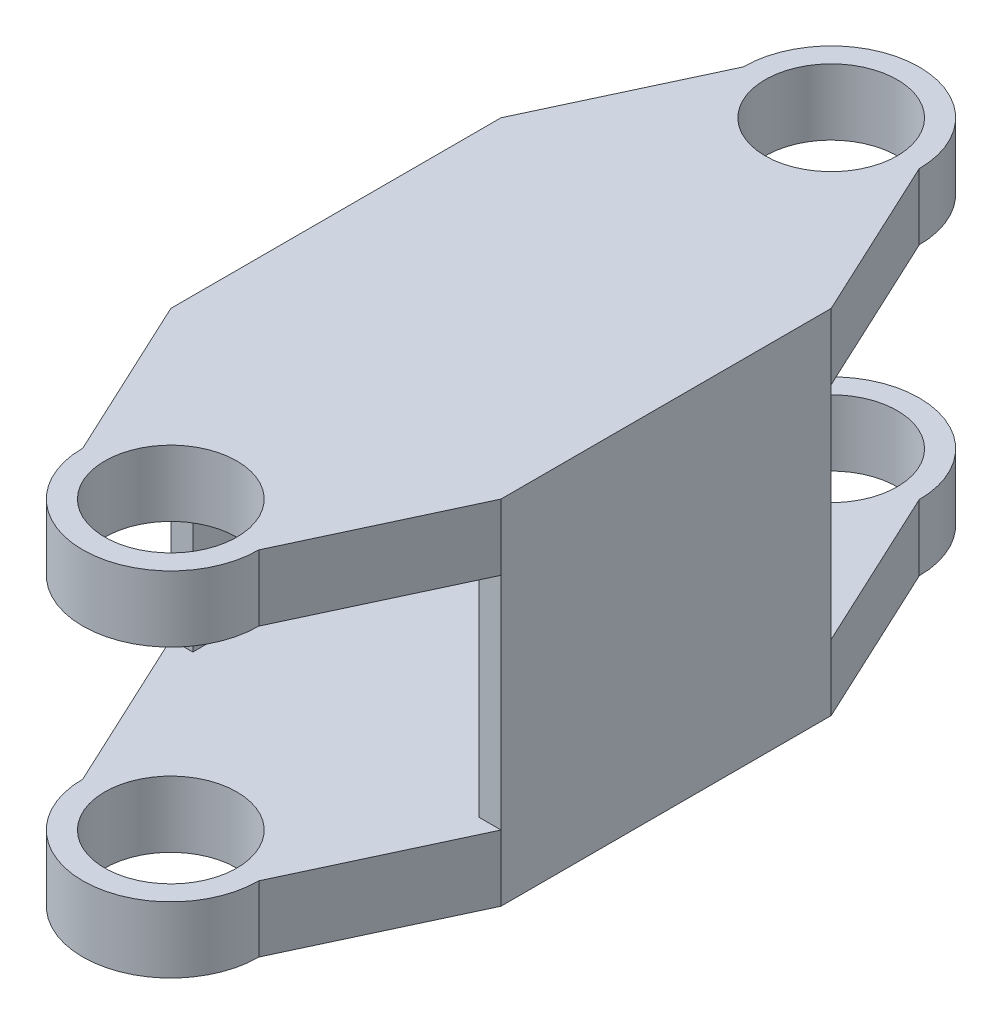
ISO-10303-21;
HEADER;
FILE_DESCRIPTION(('STEP AP214'),'2;1');
FILE_NAME('part.step','',(''),(''),'','','');
FILE_SCHEMA(('AUTOMOTIVE_DESIGN { 1 0 10303 214 1 1 1 1 }'));
ENDSEC;
DATA;
#1=APPLICATION_CONTEXT('core data for automotive mechanical design processes');
#2=APPLICATION_PROTOCOL_DEFINITION('international standard','automotive_design',2000,#1);
#3=PRODUCT_CONTEXT('',#1,'mechanical');
#4=PRODUCT('Part','Part','',(#3));
#5=PRODUCT_RELATED_PRODUCT_CATEGORY('part','',(#4));
#6=PRODUCT_DEFINITION_FORMATION('','',#4);
#7=PRODUCT_DEFINITION_CONTEXT('part definition',#1,'design');
#8=PRODUCT_DEFINITION('design','',#6,#7);
#9=PRODUCT_DEFINITION_SHAPE('','',#8);
#10=(LENGTH_UNIT() NAMED_UNIT(*) SI_UNIT(.MILLI.,.METRE.));
#11=(NAMED_UNIT(*) PLANE_ANGLE_UNIT() SI_UNIT($,.RADIAN.));
#12=(NAMED_UNIT(*) SI_UNIT($,.STERADIAN.) SOLID_ANGLE_UNIT());
#13=UNCERTAINTY_MEASURE_WITH_UNIT(LENGTH_MEASURE(1.E-05),#10,'distance_accuracy_value','');
#14=(GEOMETRIC_REPRESENTATION_CONTEXT(3) GLOBAL_UNCERTAINTY_ASSIGNED_CONTEXT((#13)) GLOBAL_UNIT_ASSIGNED_CONTEXT((#10,
#11,#12)) REPRESENTATION_CONTEXT('',''));
#15=CARTESIAN_POINT('',(0.,0.,0.));
#16=DIRECTION('',(0.,0.,1.));
#17=DIRECTION('',(1.,0.,0.));
#18=AXIS2_PLACEMENT_3D('',#15,#16,#17);
#19=CARTESIAN_POINT('',(0.,5.01,15.));
#20=DIRECTION('',(0.,1.,0.));
#21=DIRECTION('',(0.,0.,1.));
#22=AXIS2_PLACEMENT_3D('',#19,#20,#21);
#23=PLANE('',#22);
#24=CARTESIAN_POINT('',(0.,5.01,15.));
#25=DIRECTION('',(0.,1.,0.));
#26=DIRECTION('',(0.,0.,-1.));
#27=AXIS2_PLACEMENT_3D('',#24,#25,#26);
#28=CIRCLE('',#27,3.);
#29=CARTESIAN_POINT('',(0.,5.01,12.));
#30=VERTEX_POINT('',#29);
#31=EDGE_CURVE('E184',#30,#30,#28,.T.);
#32=ORIENTED_EDGE('',*,*,#31,.T.);
#33=EDGE_LOOP('',(#32));
#34=FACE_BOUND('',#33,.T.);
#35=CARTESIAN_POINT('',(0.,5.01,-15.));
#36=DIRECTION('',(0.,1.,0.));
#37=DIRECTION('',(0.,0.,1.));
#38=AXIS2_PLACEMENT_3D('',#35,#36,#37);
#39=CIRCLE('',#38,3.);
#40=CARTESIAN_POINT('',(0.,5.01,-12.));
#41=VERTEX_POINT('',#40);
#42=EDGE_CURVE('E265',#41,#41,#39,.T.);
#43=ORIENTED_EDGE('',*,*,#42,.T.);
#44=EDGE_LOOP('',(#43));
#45=FACE_BOUND('',#44,.T.);
#46=DIRECTION('',(-1.,0.,0.));
#47=VECTOR('',#46,1.);
#48=CARTESIAN_POINT('',(-7.5,5.01,-7.5));
#49=LINE('',#48,#47);
#50=CARTESIAN_POINT('',(-6.5,5.01,-7.5));
#51=VERTEX_POINT('',#50);
#52=CARTESIAN_POINT('',(-7.5,5.01,-7.5));
#53=VERTEX_POINT('',#52);
#54=EDGE_CURVE('E216',#51,#53,#49,.T.);
#55=ORIENTED_EDGE('',*,*,#54,.T.);
#56=DIRECTION('',(-0.422885465331124,0.,0.906183139995265));
#57=VECTOR('',#56,1.);
#58=CARTESIAN_POINT('',(-4.,5.01,-15.));
#59=LINE('',#58,#57);
#60=CARTESIAN_POINT('',(-4.,5.01,-15.));
#61=VERTEX_POINT('',#60);
#62=EDGE_CURVE('E156',#61,#53,#59,.T.);
#63=ORIENTED_EDGE('',*,*,#62,.F.);
#64=CARTESIAN_POINT('',(0.,5.01,-15.));
#65=DIRECTION('',(0.,1.,0.));
#66=DIRECTION('',(0.,0.,-1.));
#67=AXIS2_PLACEMENT_3D('',#64,#65,#66);
#68=CIRCLE('',#67,4.);
#69=CARTESIAN_POINT('',(4.,5.01,-15.));
#70=VERTEX_POINT('',#69);
#71=EDGE_CURVE('E154',#70,#61,#68,.T.);
#72=ORIENTED_EDGE('',*,*,#71,.F.);
#73=DIRECTION('',(-0.422885465331124,0.,-0.906183139995265));
#74=VECTOR('',#73,1.);
#75=CARTESIAN_POINT('',(4.,5.01,-15.));
#76=LINE('',#75,#74);
#77=CARTESIAN_POINT('',(7.5,5.01,-7.5));
#78=VERTEX_POINT('',#77);
#79=EDGE_CURVE('E157',#78,#70,#76,.T.);
#80=ORIENTED_EDGE('',*,*,#79,.F.);
#81=DIRECTION('',(-1.,0.,0.));
#82=VECTOR('',#81,1.);
#83=CARTESIAN_POINT('',(7.5,5.01,-7.5));
#84=LINE('',#83,#82);
#85=CARTESIAN_POINT('',(6.5,5.01,-7.5));
#86=VERTEX_POINT('',#85);
#87=EDGE_CURVE('E190',#78,#86,#84,.T.);
#88=ORIENTED_EDGE('',*,*,#87,.T.);
#89=DIRECTION('',(0.,0.,1.));
#90=VECTOR('',#89,1.);
#91=CARTESIAN_POINT('',(6.5,5.01,-7.5));
#92=LINE('',#91,#90);
#93=CARTESIAN_POINT('',(6.5,5.01,7.5));
#94=VERTEX_POINT('',#93);
#95=EDGE_CURVE('E185',#86,#94,#92,.T.);
#96=ORIENTED_EDGE('',*,*,#95,.T.);
#97=DIRECTION('',(1.,0.,0.));
#98=VECTOR('',#97,1.);
#99=CARTESIAN_POINT('',(7.5,5.01,7.5));
#100=LINE('',#99,#98);
#101=CARTESIAN_POINT('',(7.5,5.01,7.5));
#102=VERTEX_POINT('',#101);
#103=EDGE_CURVE('E182',#94,#102,#100,.T.);
#104=ORIENTED_EDGE('',*,*,#103,.T.);
#105=DIRECTION('',(0.422885465331124,0.,-0.906183139995265));
#106=VECTOR('',#105,1.);
#107=CARTESIAN_POINT('',(4.,5.01,15.));
#108=LINE('',#107,#106);
#109=CARTESIAN_POINT('',(4.,5.01,15.));
#110=VERTEX_POINT('',#109);
#111=EDGE_CURVE('E158',#110,#102,#108,.T.);
#112=ORIENTED_EDGE('',*,*,#111,.F.);
#113=CARTESIAN_POINT('',(0.,5.01,15.));
#114=DIRECTION('',(0.,1.,0.));
#115=DIRECTION('',(0.,0.,1.));
#116=AXIS2_PLACEMENT_3D('',#113,#114,#115);
#117=CIRCLE('',#116,4.);
#118=CARTESIAN_POINT('',(-4.,5.01,15.));
#119=VERTEX_POINT('',#118);
#120=EDGE_CURVE('E98',#119,#110,#117,.T.);
#121=ORIENTED_EDGE('',*,*,#120,.F.);
#122=DIRECTION('',(0.422885465331124,0.,0.906183139995265));
#123=VECTOR('',#122,1.);
#124=CARTESIAN_POINT('',(-4.,5.01,15.));
#125=LINE('',#124,#123);
#126=CARTESIAN_POINT('',(-7.5,5.01,7.5));
#127=VERTEX_POINT('',#126);
#128=EDGE_CURVE('E159',#127,#119,#125,.T.);
#129=ORIENTED_EDGE('',*,*,#128,.F.);
#130=DIRECTION('',(1.,0.,0.));
#131=VECTOR('',#130,1.);
#132=CARTESIAN_POINT('',(-7.5,5.01,7.5));
#133=LINE('',#132,#131);
#134=CARTESIAN_POINT('',(-6.5,5.01,7.5));
#135=VERTEX_POINT('',#134);
#136=EDGE_CURVE('E215',#127,#135,#133,.T.);
#137=ORIENTED_EDGE('',*,*,#136,.T.);
#138=DIRECTION('',(0.,0.,-1.));
#139=VECTOR('',#138,1.);
#140=CARTESIAN_POINT('',(-6.5,5.01,-7.5));
#141=LINE('',#140,#139);
#142=EDGE_CURVE('E212',#135,#51,#141,.T.);
#143=ORIENTED_EDGE('',*,*,#142,.T.);
#144=EDGE_LOOP('',(#55,#63,#72,#80,#88,#96,#104,#112,#121,#129,#137,#143));
#145=FACE_BOUND('',#144,.T.);
#146=ADVANCED_FACE('F55',(#34,#45,#145),#23,.F.);
#147=CARTESIAN_POINT('',(0.,8.01,15.));
#148=DIRECTION('',(0.,1.,0.));
#149=DIRECTION('',(0.,0.,1.));
#150=AXIS2_PLACEMENT_3D('',#147,#148,#149);
#151=PLANE('',#150);
#152=CARTESIAN_POINT('',(0.,8.01,-15.));
#153=DIRECTION('',(0.,1.,0.));
#154=DIRECTION('',(0.,0.,1.));
#155=AXIS2_PLACEMENT_3D('',#152,#153,#154);
#156=CIRCLE('',#155,3.);
#157=CARTESIAN_POINT('',(0.,8.01,-12.));
#158=VERTEX_POINT('',#157);
#159=EDGE_CURVE('E179',#158,#158,#156,.T.);
#160=ORIENTED_EDGE('',*,*,#159,.F.);
#161=EDGE_LOOP('',(#160));
#162=FACE_BOUND('',#161,.T.);
#163=DIRECTION('',(-0.422885465331124,0.,-0.906183139995265));
#164=VECTOR('',#163,1.);
#165=CARTESIAN_POINT('',(4.,8.01,-15.));
#166=LINE('',#165,#164);
#167=CARTESIAN_POINT('',(7.5,8.01,-7.5));
#168=VERTEX_POINT('',#167);
#169=CARTESIAN_POINT('',(4.,8.01,-15.));
#170=VERTEX_POINT('',#169);
#171=EDGE_CURVE('E167',#168,#170,#166,.T.);
#172=ORIENTED_EDGE('',*,*,#171,.T.);
#173=CARTESIAN_POINT('',(0.,8.01,-15.));
#174=DIRECTION('',(0.,1.,0.));
#175=DIRECTION('',(0.,0.,-1.));
#176=AXIS2_PLACEMENT_3D('',#173,#174,#175);
#177=CIRCLE('',#176,4.);
#178=CARTESIAN_POINT('',(-4.,8.01,-15.));
#179=VERTEX_POINT('',#178);
#180=EDGE_CURVE('E114',#170,#179,#177,.T.);
#181=ORIENTED_EDGE('',*,*,#180,.T.);
#182=DIRECTION('',(-0.422885465331124,0.,0.906183139995265));
#183=VECTOR('',#182,1.);
#184=CARTESIAN_POINT('',(-4.,8.01,-15.));
#185=LINE('',#184,#183);
#186=CARTESIAN_POINT('',(-7.5,8.01,-7.5));
#187=VERTEX_POINT('',#186);
#188=EDGE_CURVE('E274',#179,#187,#185,.T.);
#189=ORIENTED_EDGE('',*,*,#188,.T.);
#190=DIRECTION('',(0.,0.,1.));
#191=VECTOR('',#190,1.);
#192=CARTESIAN_POINT('',(-7.5,8.01,7.5));
#193=LINE('',#192,#191);
#194=CARTESIAN_POINT('',(-7.5,8.01,7.5));
#195=VERTEX_POINT('',#194);
#196=EDGE_CURVE('E276',#187,#195,#193,.T.);
#197=ORIENTED_EDGE('',*,*,#196,.T.);
#198=DIRECTION('',(0.422885465331124,0.,0.906183139995265));
#199=VECTOR('',#198,1.);
#200=CARTESIAN_POINT('',(-4.,8.01,15.));
#201=LINE('',#200,#199);
#202=CARTESIAN_POINT('',(-4.,8.01,15.));
#203=VERTEX_POINT('',#202);
#204=EDGE_CURVE('E136',#195,#203,#201,.T.);
#205=ORIENTED_EDGE('',*,*,#204,.T.);
#206=CARTESIAN_POINT('',(0.,8.01,15.));
#207=DIRECTION('',(0.,1.,0.));
#208=DIRECTION('',(0.,0.,1.));
#209=AXIS2_PLACEMENT_3D('',#206,#207,#208);
#210=CIRCLE('',#209,4.);
#211=CARTESIAN_POINT('',(4.,8.01,15.));
#212=VERTEX_POINT('',#211);
#213=EDGE_CURVE('E129',#203,#212,#210,.T.);
#214=ORIENTED_EDGE('',*,*,#213,.T.);
#215=DIRECTION('',(0.422885465331124,0.,-0.906183139995265));
#216=VECTOR('',#215,1.);
#217=CARTESIAN_POINT('',(4.,8.01,15.));
#218=LINE('',#217,#216);
#219=CARTESIAN_POINT('',(7.5,8.01,7.5));
#220=VERTEX_POINT('',#219);
#221=EDGE_CURVE('E133',#212,#220,#218,.T.);
#222=ORIENTED_EDGE('',*,*,#221,.T.);
#223=DIRECTION('',(0.,0.,-1.));
#224=VECTOR('',#223,1.);
#225=CARTESIAN_POINT('',(7.5,8.01,7.5));
#226=LINE('',#225,#224);
#227=EDGE_CURVE('E74',#220,#168,#226,.T.);
#228=ORIENTED_EDGE('',*,*,#227,.T.);
#229=EDGE_LOOP('',(#172,#181,#189,#197,#205,#214,#222,#228));
#230=FACE_BOUND('',#229,.T.);
#231=CARTESIAN_POINT('',(0.,8.01,15.));
#232=DIRECTION('',(0.,1.,0.));
#233=DIRECTION('',(0.,0.,-1.));
#234=AXIS2_PLACEMENT_3D('',#231,#232,#233);
#235=CIRCLE('',#234,3.);
#236=CARTESIAN_POINT('',(0.,8.01,12.));
#237=VERTEX_POINT('',#236);
#238=EDGE_CURVE('E262',#237,#237,#235,.T.);
#239=ORIENTED_EDGE('',*,*,#238,.F.);
#240=EDGE_LOOP('',(#239));
#241=FACE_BOUND('',#240,.T.);
#242=ADVANCED_FACE('F130',(#162,#230,#241),#151,.T.);
#243=CARTESIAN_POINT('',(4.,8.01,-15.));
#244=DIRECTION('',(-0.906183139995266,0.,0.422885465331124));
#245=DIRECTION('',(0.422885465331124,0.,0.906183139995266));
#246=AXIS2_PLACEMENT_3D('',#243,#244,#245);
#247=PLANE('',#246);
#248=ORIENTED_EDGE('',*,*,#79,.T.);
#249=DIRECTION('',(0.,-1.,0.));
#250=VECTOR('',#249,1.);
#251=CARTESIAN_POINT('',(4.,8.01,-15.));
#252=LINE('',#251,#250);
#253=EDGE_CURVE('E12',#170,#70,#252,.T.);
#254=ORIENTED_EDGE('',*,*,#253,.F.);
#255=ORIENTED_EDGE('',*,*,#171,.F.);
#256=DIRECTION('',(0.,-1.,0.));
#257=VECTOR('',#256,1.);
#258=CARTESIAN_POINT('',(7.5,8.01,-7.5));
#259=LINE('',#258,#257);
#260=EDGE_CURVE('E150',#168,#78,#259,.T.);
#261=ORIENTED_EDGE('',*,*,#260,.T.);
#262=EDGE_LOOP('',(#248,#254,#255,#261));
#263=FACE_BOUND('',#262,.T.);
#264=ADVANCED_FACE('F57',(#263),#247,.F.);
#265=CARTESIAN_POINT('',(0.,8.01,-15.));
#266=DIRECTION('',(0.,-1.,0.));
#267=DIRECTION('',(0.,0.,-1.));
#268=AXIS2_PLACEMENT_3D('',#265,#266,#267);
#269=CYLINDRICAL_SURFACE('',#268,4.);
#270=ORIENTED_EDGE('',*,*,#71,.T.);
#271=DIRECTION('',(0.,-1.,0.));
#272=VECTOR('',#271,1.);
#273=CARTESIAN_POINT('',(-4.,8.01,-15.));
#274=LINE('',#273,#272);
#275=EDGE_CURVE('E65',#179,#61,#274,.T.);
#276=ORIENTED_EDGE('',*,*,#275,.F.);
#277=ORIENTED_EDGE('',*,*,#180,.F.);
#278=ORIENTED_EDGE('',*,*,#253,.T.);
#279=EDGE_LOOP('',(#270,#276,#277,#278));
#280=FACE_BOUND('',#279,.T.);
#281=ADVANCED_FACE('F301',(#280),#269,.T.);
#282=CARTESIAN_POINT('',(-4.,8.01,-15.));
#283=DIRECTION('',(0.906183139995265,0.,0.422885465331124));
#284=DIRECTION('',(0.422885465331124,0.,-0.906183139995265));
#285=AXIS2_PLACEMENT_3D('',#282,#283,#284);
#286=PLANE('',#285);
#287=ORIENTED_EDGE('',*,*,#62,.T.);
#288=DIRECTION('',(0.,-1.,0.));
#289=VECTOR('',#288,1.);
#290=CARTESIAN_POINT('',(-7.5,8.01,-7.5));
#291=LINE('',#290,#289);
#292=EDGE_CURVE('E164',#187,#53,#291,.T.);
#293=ORIENTED_EDGE('',*,*,#292,.F.);
#294=ORIENTED_EDGE('',*,*,#188,.F.);
#295=ORIENTED_EDGE('',*,*,#275,.T.);
#296=EDGE_LOOP('',(#287,#293,#294,#295));
#297=FACE_BOUND('',#296,.T.);
#298=ADVANCED_FACE('F303',(#297),#286,.F.);
#299=CARTESIAN_POINT('',(-7.5,8.01,7.5));
#300=DIRECTION('',(1.,0.,0.));
#301=DIRECTION('',(0.,0.,-1.));
#302=AXIS2_PLACEMENT_3D('',#299,#300,#301);
#303=PLANE('',#302);
#304=ORIENTED_EDGE('',*,*,#292,.T.);
#305=DIRECTION('',(0.,1.,0.));
#306=VECTOR('',#305,1.);
#307=CARTESIAN_POINT('',(-7.5,0.,-7.5));
#308=LINE('',#307,#306);
#309=CARTESIAN_POINT('',(-7.5,-5.01,-7.5));
#310=VERTEX_POINT('',#309);
#311=EDGE_CURVE('E238',#310,#53,#308,.T.);
#312=ORIENTED_EDGE('',*,*,#311,.F.);
#313=DIRECTION('',(0.,1.,0.));
#314=VECTOR('',#313,1.);
#315=CARTESIAN_POINT('',(-7.5,-8.01,-7.5));
#316=LINE('',#315,#314);
#317=CARTESIAN_POINT('',(-7.5,-8.01,-7.5));
#318=VERTEX_POINT('',#317);
#319=EDGE_CURVE('E418',#318,#310,#316,.T.);
#320=ORIENTED_EDGE('',*,*,#319,.F.);
#321=DIRECTION('',(0.,0.,1.));
#322=VECTOR('',#321,1.);
#323=CARTESIAN_POINT('',(-7.5,-8.01,7.5));
#324=LINE('',#323,#322);
#325=CARTESIAN_POINT('',(-7.5,-8.01,7.5));
#326=VERTEX_POINT('',#325);
#327=EDGE_CURVE('E490',#318,#326,#324,.T.);
#328=ORIENTED_EDGE('',*,*,#327,.T.);
#329=DIRECTION('',(0.,1.,0.));
#330=VECTOR('',#329,1.);
#331=CARTESIAN_POINT('',(-7.5,-8.01,7.5));
#332=LINE('',#331,#330);
#333=CARTESIAN_POINT('',(-7.5,-5.01,7.5));
#334=VERTEX_POINT('',#333);
#335=EDGE_CURVE('E414',#326,#334,#332,.T.);
#336=ORIENTED_EDGE('',*,*,#335,.T.);
#337=DIRECTION('',(0.,1.,0.));
#338=VECTOR('',#337,1.);
#339=CARTESIAN_POINT('',(-7.5,0.,7.5));
#340=LINE('',#339,#338);
#341=EDGE_CURVE('E285',#334,#127,#340,.T.);
#342=ORIENTED_EDGE('',*,*,#341,.T.);
#343=DIRECTION('',(0.,-1.,0.));
#344=VECTOR('',#343,1.);
#345=CARTESIAN_POINT('',(-7.5,8.01,7.5));
#346=LINE('',#345,#344);
#347=EDGE_CURVE('E162',#195,#127,#346,.T.);
#348=ORIENTED_EDGE('',*,*,#347,.F.);
#349=ORIENTED_EDGE('',*,*,#196,.F.);
#350=EDGE_LOOP('',(#304,#312,#320,#328,#336,#342,#348,#349));
#351=FACE_BOUND('',#350,.T.);
#352=ADVANCED_FACE('F282',(#351),#303,.F.);
#353=CARTESIAN_POINT('',(-4.,8.01,15.));
#354=DIRECTION('',(0.906183139995265,0.,-0.422885465331124));
#355=DIRECTION('',(-0.422885465331124,0.,-0.906183139995265));
#356=AXIS2_PLACEMENT_3D('',#353,#354,#355);
#357=PLANE('',#356);
#358=ORIENTED_EDGE('',*,*,#128,.T.);
#359=DIRECTION('',(0.,-1.,0.));
#360=VECTOR('',#359,1.);
#361=CARTESIAN_POINT('',(-4.,8.01,15.));
#362=LINE('',#361,#360);
#363=EDGE_CURVE('E144',#203,#119,#362,.T.);
#364=ORIENTED_EDGE('',*,*,#363,.F.);
#365=ORIENTED_EDGE('',*,*,#204,.F.);
#366=ORIENTED_EDGE('',*,*,#347,.T.);
#367=EDGE_LOOP('',(#358,#364,#365,#366));
#368=FACE_BOUND('',#367,.T.);
#369=ADVANCED_FACE('F289',(#368),#357,.F.);
#370=CARTESIAN_POINT('',(0.,8.01,15.));
#371=DIRECTION('',(0.,-1.,0.));
#372=DIRECTION('',(0.,0.,-1.));
#373=AXIS2_PLACEMENT_3D('',#370,#371,#372);
#374=CYLINDRICAL_SURFACE('',#373,4.);
#375=ORIENTED_EDGE('',*,*,#120,.T.);
#376=DIRECTION('',(0.,-1.,0.));
#377=VECTOR('',#376,1.);
#378=CARTESIAN_POINT('',(4.,8.01,15.));
#379=LINE('',#378,#377);
#380=EDGE_CURVE('E139',#212,#110,#379,.T.);
#381=ORIENTED_EDGE('',*,*,#380,.F.);
#382=ORIENTED_EDGE('',*,*,#213,.F.);
#383=ORIENTED_EDGE('',*,*,#363,.T.);
#384=EDGE_LOOP('',(#375,#381,#382,#383));
#385=FACE_BOUND('',#384,.T.);
#386=ADVANCED_FACE('F140',(#385),#374,.T.);
#387=CARTESIAN_POINT('',(4.,8.01,15.));
#388=DIRECTION('',(-0.906183139995265,0.,-0.422885465331124));
#389=DIRECTION('',(-0.422885465331124,0.,0.906183139995265));
#390=AXIS2_PLACEMENT_3D('',#387,#388,#389);
#391=PLANE('',#390);
#392=ORIENTED_EDGE('',*,*,#111,.T.);
#393=DIRECTION('',(0.,-1.,0.));
#394=VECTOR('',#393,1.);
#395=CARTESIAN_POINT('',(7.5,8.01,7.5));
#396=LINE('',#395,#394);
#397=EDGE_CURVE('E145',#220,#102,#396,.T.);
#398=ORIENTED_EDGE('',*,*,#397,.F.);
#399=ORIENTED_EDGE('',*,*,#221,.F.);
#400=ORIENTED_EDGE('',*,*,#380,.T.);
#401=EDGE_LOOP('',(#392,#398,#399,#400));
#402=FACE_BOUND('',#401,.T.);
#403=ADVANCED_FACE('F147',(#402),#391,.F.);
#404=CARTESIAN_POINT('',(7.5,8.01,7.5));
#405=DIRECTION('',(-1.,0.,0.));
#406=DIRECTION('',(0.,0.,1.));
#407=AXIS2_PLACEMENT_3D('',#404,#405,#406);
#408=PLANE('',#407);
#409=ORIENTED_EDGE('',*,*,#397,.T.);
#410=DIRECTION('',(0.,1.,0.));
#411=VECTOR('',#410,1.);
#412=CARTESIAN_POINT('',(7.5,0.,7.5));
#413=LINE('',#412,#411);
#414=CARTESIAN_POINT('',(7.5,-5.01,7.5));
#415=VERTEX_POINT('',#414);
#416=EDGE_CURVE('E106',#415,#102,#413,.T.);
#417=ORIENTED_EDGE('',*,*,#416,.F.);
#418=DIRECTION('',(0.,1.,0.));
#419=VECTOR('',#418,1.);
#420=CARTESIAN_POINT('',(7.5,-8.01,7.5));
#421=LINE('',#420,#419);
#422=CARTESIAN_POINT('',(7.5,-8.01,7.5));
#423=VERTEX_POINT('',#422);
#424=EDGE_CURVE('E394',#423,#415,#421,.T.);
#425=ORIENTED_EDGE('',*,*,#424,.F.);
#426=DIRECTION('',(0.,0.,-1.));
#427=VECTOR('',#426,1.);
#428=CARTESIAN_POINT('',(7.5,-8.01,7.5));
#429=LINE('',#428,#427);
#430=CARTESIAN_POINT('',(7.5,-8.01,-7.5));
#431=VERTEX_POINT('',#430);
#432=EDGE_CURVE('E427',#423,#431,#429,.T.);
#433=ORIENTED_EDGE('',*,*,#432,.T.);
#434=DIRECTION('',(0.,1.,0.));
#435=VECTOR('',#434,1.);
#436=CARTESIAN_POINT('',(7.5,-8.01,-7.5));
#437=LINE('',#436,#435);
#438=CARTESIAN_POINT('',(7.5,-5.01,-7.5));
#439=VERTEX_POINT('',#438);
#440=EDGE_CURVE('E423',#431,#439,#437,.T.);
#441=ORIENTED_EDGE('',*,*,#440,.T.);
#442=DIRECTION('',(0.,1.,0.));
#443=VECTOR('',#442,1.);
#444=CARTESIAN_POINT('',(7.5,0.,-7.5));
#445=LINE('',#444,#443);
#446=EDGE_CURVE('E249',#439,#78,#445,.T.);
#447=ORIENTED_EDGE('',*,*,#446,.T.);
#448=ORIENTED_EDGE('',*,*,#260,.F.);
#449=ORIENTED_EDGE('',*,*,#227,.F.);
#450=EDGE_LOOP('',(#409,#417,#425,#433,#441,#447,#448,#449));
#451=FACE_BOUND('',#450,.T.);
#452=ADVANCED_FACE('F291',(#451),#408,.F.);
#453=CARTESIAN_POINT('',(0.,8.01,-15.));
#454=DIRECTION('',(0.,-1.,0.));
#455=DIRECTION('',(0.,0.,-1.));
#456=AXIS2_PLACEMENT_3D('',#453,#454,#455);
#457=CYLINDRICAL_SURFACE('',#456,3.);
#458=ORIENTED_EDGE('',*,*,#159,.T.);
#459=EDGE_LOOP('',(#458));
#460=FACE_BOUND('',#459,.T.);
#461=ORIENTED_EDGE('',*,*,#42,.F.);
#462=EDGE_LOOP('',(#461));
#463=FACE_BOUND('',#462,.T.);
#464=ADVANCED_FACE('F552',(#460,#463),#457,.F.);
#465=CARTESIAN_POINT('',(0.,8.01,15.));
#466=DIRECTION('',(0.,-1.,0.));
#467=DIRECTION('',(0.,0.,-1.));
#468=AXIS2_PLACEMENT_3D('',#465,#466,#467);
#469=CYLINDRICAL_SURFACE('',#468,3.);
#470=ORIENTED_EDGE('',*,*,#238,.T.);
#471=EDGE_LOOP('',(#470));
#472=FACE_BOUND('',#471,.T.);
#473=ORIENTED_EDGE('',*,*,#31,.F.);
#474=EDGE_LOOP('',(#473));
#475=FACE_BOUND('',#474,.T.);
#476=ADVANCED_FACE('F595',(#472,#475),#469,.F.);
#477=CARTESIAN_POINT('',(0.,0.,-7.5));
#478=DIRECTION('',(0.,0.,1.));
#479=DIRECTION('',(1.,0.,0.));
#480=AXIS2_PLACEMENT_3D('',#477,#478,#479);
#481=PLANE('',#480);
#482=DIRECTION('',(0.,1.,0.));
#483=VECTOR('',#482,1.);
#484=CARTESIAN_POINT('',(6.5,0.,-7.5));
#485=LINE('',#484,#483);
#486=CARTESIAN_POINT('',(6.5,-5.01,-7.5));
#487=VERTEX_POINT('',#486);
#488=EDGE_CURVE('E221',#487,#86,#485,.T.);
#489=ORIENTED_EDGE('',*,*,#488,.T.);
#490=ORIENTED_EDGE('',*,*,#87,.F.);
#491=ORIENTED_EDGE('',*,*,#446,.F.);
#492=DIRECTION('',(-1.,0.,0.));
#493=VECTOR('',#492,1.);
#494=CARTESIAN_POINT('',(7.5,-5.01,-7.5));
#495=LINE('',#494,#493);
#496=EDGE_CURVE('E441',#439,#487,#495,.T.);
#497=ORIENTED_EDGE('',*,*,#496,.T.);
#498=EDGE_LOOP('',(#489,#490,#491,#497));
#499=FACE_BOUND('',#498,.T.);
#500=ADVANCED_FACE('F328',(#499),#481,.F.);
#501=CARTESIAN_POINT('',(6.5,0.,0.));
#502=DIRECTION('',(1.,0.,0.));
#503=DIRECTION('',(0.,1.,0.));
#504=AXIS2_PLACEMENT_3D('',#501,#502,#503);
#505=PLANE('',#504);
#506=DIRECTION('',(0.,1.,0.));
#507=VECTOR('',#506,1.);
#508=CARTESIAN_POINT('',(6.5,0.,7.5));
#509=LINE('',#508,#507);
#510=CARTESIAN_POINT('',(6.5,-5.01,7.5));
#511=VERTEX_POINT('',#510);
#512=EDGE_CURVE('E246',#511,#94,#509,.T.);
#513=ORIENTED_EDGE('',*,*,#512,.T.);
#514=ORIENTED_EDGE('',*,*,#95,.F.);
#515=ORIENTED_EDGE('',*,*,#488,.F.);
#516=DIRECTION('',(0.,0.,1.));
#517=VECTOR('',#516,1.);
#518=CARTESIAN_POINT('',(6.5,-5.01,-7.5));
#519=LINE('',#518,#517);
#520=EDGE_CURVE('E338',#487,#511,#519,.T.);
#521=ORIENTED_EDGE('',*,*,#520,.T.);
#522=EDGE_LOOP('',(#513,#514,#515,#521));
#523=FACE_BOUND('',#522,.T.);
#524=ADVANCED_FACE('F333',(#523),#505,.F.);
#525=CARTESIAN_POINT('',(0.,0.,7.5));
#526=DIRECTION('',(0.,0.,-1.));
#527=DIRECTION('',(-1.,0.,0.));
#528=AXIS2_PLACEMENT_3D('',#525,#526,#527);
#529=PLANE('',#528);
#530=ORIENTED_EDGE('',*,*,#416,.T.);
#531=ORIENTED_EDGE('',*,*,#103,.F.);
#532=ORIENTED_EDGE('',*,*,#512,.F.);
#533=DIRECTION('',(1.,0.,0.));
#534=VECTOR('',#533,1.);
#535=CARTESIAN_POINT('',(7.5,-5.01,7.5));
#536=LINE('',#535,#534);
#537=EDGE_CURVE('E341',#511,#415,#536,.T.);
#538=ORIENTED_EDGE('',*,*,#537,.T.);
#539=EDGE_LOOP('',(#530,#531,#532,#538));
#540=FACE_BOUND('',#539,.T.);
#541=ADVANCED_FACE('F340',(#540),#529,.F.);
#542=CARTESIAN_POINT('',(0.,0.,-7.49999999999999));
#543=DIRECTION('',(0.,0.,1.));
#544=DIRECTION('',(1.,0.,0.));
#545=AXIS2_PLACEMENT_3D('',#542,#543,#544);
#546=PLANE('',#545);
#547=ORIENTED_EDGE('',*,*,#311,.T.);
#548=ORIENTED_EDGE('',*,*,#54,.F.);
#549=DIRECTION('',(0.,1.,0.));
#550=VECTOR('',#549,1.);
#551=CARTESIAN_POINT('',(-6.5,0.,-7.5));
#552=LINE('',#551,#550);
#553=CARTESIAN_POINT('',(-6.5,-5.01,-7.5));
#554=VERTEX_POINT('',#553);
#555=EDGE_CURVE('E224',#554,#51,#552,.T.);
#556=ORIENTED_EDGE('',*,*,#555,.F.);
#557=DIRECTION('',(-1.,0.,0.));
#558=VECTOR('',#557,1.);
#559=CARTESIAN_POINT('',(-7.5,-5.01,-7.5));
#560=LINE('',#559,#558);
#561=EDGE_CURVE('E462',#554,#310,#560,.T.);
#562=ORIENTED_EDGE('',*,*,#561,.T.);
#563=EDGE_LOOP('',(#547,#548,#556,#562));
#564=FACE_BOUND('',#563,.T.);
#565=ADVANCED_FACE('F477',(#564),#546,.F.);
#566=CARTESIAN_POINT('',(0.,0.,7.5));
#567=DIRECTION('',(0.,0.,-1.));
#568=DIRECTION('',(-1.,0.,0.));
#569=AXIS2_PLACEMENT_3D('',#566,#567,#568);
#570=PLANE('',#569);
#571=DIRECTION('',(0.,1.,0.));
#572=VECTOR('',#571,1.);
#573=CARTESIAN_POINT('',(-6.5,0.,7.5));
#574=LINE('',#573,#572);
#575=CARTESIAN_POINT('',(-6.5,-5.01,7.5));
#576=VERTEX_POINT('',#575);
#577=EDGE_CURVE('E230',#576,#135,#574,.T.);
#578=ORIENTED_EDGE('',*,*,#577,.T.);
#579=ORIENTED_EDGE('',*,*,#136,.F.);
#580=ORIENTED_EDGE('',*,*,#341,.F.);
#581=DIRECTION('',(1.,0.,0.));
#582=VECTOR('',#581,1.);
#583=CARTESIAN_POINT('',(-7.5,-5.01,7.5));
#584=LINE('',#583,#582);
#585=EDGE_CURVE('E445',#334,#576,#584,.T.);
#586=ORIENTED_EDGE('',*,*,#585,.T.);
#587=EDGE_LOOP('',(#578,#579,#580,#586));
#588=FACE_BOUND('',#587,.T.);
#589=ADVANCED_FACE('F487',(#588),#570,.F.);
#590=CARTESIAN_POINT('',(-6.5,0.,0.));
#591=DIRECTION('',(-1.,0.,0.));
#592=DIRECTION('',(0.,0.,1.));
#593=AXIS2_PLACEMENT_3D('',#590,#591,#592);
#594=PLANE('',#593);
#595=ORIENTED_EDGE('',*,*,#555,.T.);
#596=ORIENTED_EDGE('',*,*,#142,.F.);
#597=ORIENTED_EDGE('',*,*,#577,.F.);
#598=DIRECTION('',(0.,0.,-1.));
#599=VECTOR('',#598,1.);
#600=CARTESIAN_POINT('',(-6.5,-5.01,-7.5));
#601=LINE('',#600,#599);
#602=EDGE_CURVE('E460',#576,#554,#601,.T.);
#603=ORIENTED_EDGE('',*,*,#602,.T.);
#604=EDGE_LOOP('',(#595,#596,#597,#603));
#605=FACE_BOUND('',#604,.T.);
#606=ADVANCED_FACE('F485',(#605),#594,.F.);
#607=CARTESIAN_POINT('',(0.,-5.01,15.));
#608=DIRECTION('',(0.,-1.,0.));
#609=DIRECTION('',(0.,0.,1.));
#610=AXIS2_PLACEMENT_3D('',#607,#608,#609);
#611=PLANE('',#610);
#612=CARTESIAN_POINT('',(0.,-5.01,15.));
#613=DIRECTION('',(0.,1.,0.));
#614=DIRECTION('',(0.,0.,-1.));
#615=AXIS2_PLACEMENT_3D('',#612,#613,#614);
#616=CIRCLE('',#615,3.);
#617=CARTESIAN_POINT('',(0.,-5.01,12.));
#618=VERTEX_POINT('',#617);
#619=EDGE_CURVE('E437',#618,#618,#616,.T.);
#620=ORIENTED_EDGE('',*,*,#619,.F.);
#621=EDGE_LOOP('',(#620));
#622=FACE_BOUND('',#621,.T.);
#623=CARTESIAN_POINT('',(0.,-5.01,-15.));
#624=DIRECTION('',(0.,1.,0.));
#625=DIRECTION('',(0.,0.,1.));
#626=AXIS2_PLACEMENT_3D('',#623,#624,#625);
#627=CIRCLE('',#626,3.);
#628=CARTESIAN_POINT('',(0.,-5.01,-12.));
#629=VERTEX_POINT('',#628);
#630=EDGE_CURVE('E518',#629,#629,#627,.T.);
#631=ORIENTED_EDGE('',*,*,#630,.F.);
#632=EDGE_LOOP('',(#631));
#633=FACE_BOUND('',#632,.T.);
#634=ORIENTED_EDGE('',*,*,#561,.F.);
#635=ORIENTED_EDGE('',*,*,#602,.F.);
#636=ORIENTED_EDGE('',*,*,#585,.F.);
#637=DIRECTION('',(0.422885465331124,0.,0.906183139995265));
#638=VECTOR('',#637,1.);
#639=CARTESIAN_POINT('',(-4.,-5.01,15.));
#640=LINE('',#639,#638);
#641=CARTESIAN_POINT('',(-4.,-5.01,15.));
#642=VERTEX_POINT('',#641);
#643=EDGE_CURVE('E405',#334,#642,#640,.T.);
#644=ORIENTED_EDGE('',*,*,#643,.T.);
#645=CARTESIAN_POINT('',(0.,-5.01,15.));
#646=DIRECTION('',(0.,1.,0.));
#647=DIRECTION('',(0.,0.,1.));
#648=AXIS2_PLACEMENT_3D('',#645,#646,#647);
#649=CIRCLE('',#648,4.);
#650=CARTESIAN_POINT('',(4.,-5.01,15.));
#651=VERTEX_POINT('',#650);
#652=EDGE_CURVE('E386',#642,#651,#649,.T.);
#653=ORIENTED_EDGE('',*,*,#652,.T.);
#654=DIRECTION('',(0.422885465331124,0.,-0.906183139995265));
#655=VECTOR('',#654,1.);
#656=CARTESIAN_POINT('',(4.,-5.01,15.));
#657=LINE('',#656,#655);
#658=EDGE_CURVE('E396',#651,#415,#657,.T.);
#659=ORIENTED_EDGE('',*,*,#658,.T.);
#660=ORIENTED_EDGE('',*,*,#537,.F.);
#661=ORIENTED_EDGE('',*,*,#520,.F.);
#662=ORIENTED_EDGE('',*,*,#496,.F.);
#663=DIRECTION('',(-0.422885465331124,0.,-0.906183139995265));
#664=VECTOR('',#663,1.);
#665=CARTESIAN_POINT('',(4.,-5.01,-15.));
#666=LINE('',#665,#664);
#667=CARTESIAN_POINT('',(4.,-5.01,-15.));
#668=VERTEX_POINT('',#667);
#669=EDGE_CURVE('E430',#439,#668,#666,.T.);
#670=ORIENTED_EDGE('',*,*,#669,.T.);
#671=CARTESIAN_POINT('',(0.,-5.01,-15.));
#672=DIRECTION('',(0.,1.,0.));
#673=DIRECTION('',(0.,0.,-1.));
#674=AXIS2_PLACEMENT_3D('',#671,#672,#673);
#675=CIRCLE('',#674,4.);
#676=CARTESIAN_POINT('',(-4.,-5.01,-15.));
#677=VERTEX_POINT('',#676);
#678=EDGE_CURVE('E410',#668,#677,#675,.T.);
#679=ORIENTED_EDGE('',*,*,#678,.T.);
#680=DIRECTION('',(-0.422885465331124,0.,0.906183139995265));
#681=VECTOR('',#680,1.);
#682=CARTESIAN_POINT('',(-4.,-5.01,-15.));
#683=LINE('',#682,#681);
#684=EDGE_CURVE('E407',#677,#310,#683,.T.);
#685=ORIENTED_EDGE('',*,*,#684,.T.);
#686=EDGE_LOOP('',(#634,#635,#636,#644,#653,#659,#660,#661,#662,#670,#679,#685));
#687=FACE_BOUND('',#686,.T.);
#688=ADVANCED_FACE('F402',(#622,#633,#687),#611,.F.);
#689=CARTESIAN_POINT('',(0.,-8.01,15.));
#690=DIRECTION('',(0.,-1.,0.));
#691=DIRECTION('',(0.,0.,1.));
#692=AXIS2_PLACEMENT_3D('',#689,#690,#691);
#693=PLANE('',#692);
#694=CARTESIAN_POINT('',(0.,-8.01,-15.));
#695=DIRECTION('',(0.,1.,0.));
#696=DIRECTION('',(0.,0.,1.));
#697=AXIS2_PLACEMENT_3D('',#694,#695,#696);
#698=CIRCLE('',#697,3.);
#699=CARTESIAN_POINT('',(0.,-8.01,-12.));
#700=VERTEX_POINT('',#699);
#701=EDGE_CURVE('E433',#700,#700,#698,.T.);
#702=ORIENTED_EDGE('',*,*,#701,.T.);
#703=EDGE_LOOP('',(#702));
#704=FACE_BOUND('',#703,.T.);
#705=DIRECTION('',(-0.422885465331124,0.,-0.906183139995265));
#706=VECTOR('',#705,1.);
#707=CARTESIAN_POINT('',(4.,-8.01,-15.));
#708=LINE('',#707,#706);
#709=CARTESIAN_POINT('',(4.,-8.01,-15.));
#710=VERTEX_POINT('',#709);
#711=EDGE_CURVE('E399',#431,#710,#708,.T.);
#712=ORIENTED_EDGE('',*,*,#711,.F.);
#713=ORIENTED_EDGE('',*,*,#432,.F.);
#714=DIRECTION('',(0.422885465331124,0.,-0.906183139995265));
#715=VECTOR('',#714,1.);
#716=CARTESIAN_POINT('',(4.,-8.01,15.));
#717=LINE('',#716,#715);
#718=CARTESIAN_POINT('',(4.,-8.01,15.));
#719=VERTEX_POINT('',#718);
#720=EDGE_CURVE('E502',#719,#423,#717,.T.);
#721=ORIENTED_EDGE('',*,*,#720,.F.);
#722=CARTESIAN_POINT('',(0.,-8.01,15.));
#723=DIRECTION('',(0.,1.,0.));
#724=DIRECTION('',(0.,0.,1.));
#725=AXIS2_PLACEMENT_3D('',#722,#723,#724);
#726=CIRCLE('',#725,4.);
#727=CARTESIAN_POINT('',(-4.,-8.01,15.));
#728=VERTEX_POINT('',#727);
#729=EDGE_CURVE('E389',#728,#719,#726,.T.);
#730=ORIENTED_EDGE('',*,*,#729,.F.);
#731=DIRECTION('',(0.422885465331124,0.,0.906183139995265));
#732=VECTOR('',#731,1.);
#733=CARTESIAN_POINT('',(-4.,-8.01,15.));
#734=LINE('',#733,#732);
#735=EDGE_CURVE('E495',#326,#728,#734,.T.);
#736=ORIENTED_EDGE('',*,*,#735,.F.);
#737=ORIENTED_EDGE('',*,*,#327,.F.);
#738=DIRECTION('',(-0.422885465331124,0.,0.906183139995265));
#739=VECTOR('',#738,1.);
#740=CARTESIAN_POINT('',(-4.,-8.01,-15.));
#741=LINE('',#740,#739);
#742=CARTESIAN_POINT('',(-4.,-8.01,-15.));
#743=VERTEX_POINT('',#742);
#744=EDGE_CURVE('E515',#743,#318,#741,.T.);
#745=ORIENTED_EDGE('',*,*,#744,.F.);
#746=CARTESIAN_POINT('',(0.,-8.01,-15.));
#747=DIRECTION('',(0.,1.,0.));
#748=DIRECTION('',(0.,0.,-1.));
#749=AXIS2_PLACEMENT_3D('',#746,#747,#748);
#750=CIRCLE('',#749,4.);
#751=EDGE_CURVE('E512',#710,#743,#750,.T.);
#752=ORIENTED_EDGE('',*,*,#751,.F.);
#753=EDGE_LOOP('',(#712,#713,#721,#730,#736,#737,#745,#752));
#754=FACE_BOUND('',#753,.T.);
#755=CARTESIAN_POINT('',(0.,-8.01,15.));
#756=DIRECTION('',(0.,1.,0.));
#757=DIRECTION('',(0.,0.,-1.));
#758=AXIS2_PLACEMENT_3D('',#755,#756,#757);
#759=CIRCLE('',#758,3.);
#760=CARTESIAN_POINT('',(0.,-8.01,12.));
#761=VERTEX_POINT('',#760);
#762=EDGE_CURVE('E724',#761,#761,#759,.T.);
#763=ORIENTED_EDGE('',*,*,#762,.T.);
#764=EDGE_LOOP('',(#763));
#765=FACE_BOUND('',#764,.T.);
#766=ADVANCED_FACE('F499',(#704,#754,#765),#693,.T.);
#767=CARTESIAN_POINT('',(4.,-8.01,-15.));
#768=DIRECTION('',(-0.906183139995266,0.,0.422885465331124));
#769=DIRECTION('',(0.422885465331124,0.,0.906183139995266));
#770=AXIS2_PLACEMENT_3D('',#767,#768,#769);
#771=PLANE('',#770);
#772=ORIENTED_EDGE('',*,*,#669,.F.);
#773=ORIENTED_EDGE('',*,*,#440,.F.);
#774=ORIENTED_EDGE('',*,*,#711,.T.);
#775=DIRECTION('',(0.,1.,0.));
#776=VECTOR('',#775,1.);
#777=CARTESIAN_POINT('',(4.,-8.01,-15.));
#778=LINE('',#777,#776);
#779=EDGE_CURVE('E417',#710,#668,#778,.T.);
#780=ORIENTED_EDGE('',*,*,#779,.T.);
#781=EDGE_LOOP('',(#772,#773,#774,#780));
#782=FACE_BOUND('',#781,.T.);
#783=ADVANCED_FACE('F527',(#782),#771,.F.);
#784=CARTESIAN_POINT('',(0.,-8.01,-15.));
#785=DIRECTION('',(0.,1.,0.));
#786=DIRECTION('',(0.,0.,-1.));
#787=AXIS2_PLACEMENT_3D('',#784,#785,#786);
#788=CYLINDRICAL_SURFACE('',#787,4.);
#789=ORIENTED_EDGE('',*,*,#678,.F.);
#790=ORIENTED_EDGE('',*,*,#779,.F.);
#791=ORIENTED_EDGE('',*,*,#751,.T.);
#792=DIRECTION('',(0.,1.,0.));
#793=VECTOR('',#792,1.);
#794=CARTESIAN_POINT('',(-4.,-8.01,-15.));
#795=LINE('',#794,#793);
#796=EDGE_CURVE('E415',#743,#677,#795,.T.);
#797=ORIENTED_EDGE('',*,*,#796,.T.);
#798=EDGE_LOOP('',(#789,#790,#791,#797));
#799=FACE_BOUND('',#798,.T.);
#800=ADVANCED_FACE('F526',(#799),#788,.T.);
#801=CARTESIAN_POINT('',(-4.,-8.01,-15.));
#802=DIRECTION('',(0.906183139995265,0.,0.422885465331124));
#803=DIRECTION('',(0.422885465331124,0.,-0.906183139995265));
#804=AXIS2_PLACEMENT_3D('',#801,#802,#803);
#805=PLANE('',#804);
#806=ORIENTED_EDGE('',*,*,#684,.F.);
#807=ORIENTED_EDGE('',*,*,#796,.F.);
#808=ORIENTED_EDGE('',*,*,#744,.T.);
#809=ORIENTED_EDGE('',*,*,#319,.T.);
#810=EDGE_LOOP('',(#806,#807,#808,#809));
#811=FACE_BOUND('',#810,.T.);
#812=ADVANCED_FACE('F523',(#811),#805,.F.);
#813=CARTESIAN_POINT('',(-4.,-8.01,15.));
#814=DIRECTION('',(0.906183139995265,0.,-0.422885465331124));
#815=DIRECTION('',(-0.422885465331124,0.,-0.906183139995265));
#816=AXIS2_PLACEMENT_3D('',#813,#814,#815);
#817=PLANE('',#816);
#818=ORIENTED_EDGE('',*,*,#643,.F.);
#819=ORIENTED_EDGE('',*,*,#335,.F.);
#820=ORIENTED_EDGE('',*,*,#735,.T.);
#821=DIRECTION('',(0.,1.,0.));
#822=VECTOR('',#821,1.);
#823=CARTESIAN_POINT('',(-4.,-8.01,15.));
#824=LINE('',#823,#822);
#825=EDGE_CURVE('E393',#728,#642,#824,.T.);
#826=ORIENTED_EDGE('',*,*,#825,.T.);
#827=EDGE_LOOP('',(#818,#819,#820,#826));
#828=FACE_BOUND('',#827,.T.);
#829=ADVANCED_FACE('F494',(#828),#817,.F.);
#830=CARTESIAN_POINT('',(0.,-8.01,15.));
#831=DIRECTION('',(0.,1.,0.));
#832=DIRECTION('',(0.,0.,-1.));
#833=AXIS2_PLACEMENT_3D('',#830,#831,#832);
#834=CYLINDRICAL_SURFACE('',#833,4.);
#835=ORIENTED_EDGE('',*,*,#652,.F.);
#836=ORIENTED_EDGE('',*,*,#825,.F.);
#837=ORIENTED_EDGE('',*,*,#729,.T.);
#838=DIRECTION('',(0.,1.,0.));
#839=VECTOR('',#838,1.);
#840=CARTESIAN_POINT('',(4.,-8.01,15.));
#841=LINE('',#840,#839);
#842=EDGE_CURVE('E382',#719,#651,#841,.T.);
#843=ORIENTED_EDGE('',*,*,#842,.T.);
#844=EDGE_LOOP('',(#835,#836,#837,#843));
#845=FACE_BOUND('',#844,.T.);
#846=ADVANCED_FACE('F384',(#845),#834,.T.);
#847=CARTESIAN_POINT('',(4.,-8.01,15.));
#848=DIRECTION('',(-0.906183139995265,0.,-0.422885465331124));
#849=DIRECTION('',(-0.422885465331124,0.,0.906183139995265));
#850=AXIS2_PLACEMENT_3D('',#847,#848,#849);
#851=PLANE('',#850);
#852=ORIENTED_EDGE('',*,*,#658,.F.);
#853=ORIENTED_EDGE('',*,*,#842,.F.);
#854=ORIENTED_EDGE('',*,*,#720,.T.);
#855=ORIENTED_EDGE('',*,*,#424,.T.);
#856=EDGE_LOOP('',(#852,#853,#854,#855));
#857=FACE_BOUND('',#856,.T.);
#858=ADVANCED_FACE('F397',(#857),#851,.F.);
#859=CARTESIAN_POINT('',(0.,-8.01,-15.));
#860=DIRECTION('',(0.,1.,0.));
#861=DIRECTION('',(0.,0.,-1.));
#862=AXIS2_PLACEMENT_3D('',#859,#860,#861);
#863=CYLINDRICAL_SURFACE('',#862,3.);
#864=ORIENTED_EDGE('',*,*,#701,.F.);
#865=EDGE_LOOP('',(#864));
#866=FACE_BOUND('',#865,.T.);
#867=ORIENTED_EDGE('',*,*,#630,.T.);
#868=EDGE_LOOP('',(#867));
#869=FACE_BOUND('',#868,.T.);
#870=ADVANCED_FACE('F698',(#866,#869),#863,.F.);
#871=CARTESIAN_POINT('',(0.,-8.01,15.));
#872=DIRECTION('',(0.,1.,0.));
#873=DIRECTION('',(0.,0.,-1.));
#874=AXIS2_PLACEMENT_3D('',#871,#872,#873);
#875=CYLINDRICAL_SURFACE('',#874,3.);
#876=ORIENTED_EDGE('',*,*,#762,.F.);
#877=EDGE_LOOP('',(#876));
#878=FACE_BOUND('',#877,.T.);
#879=ORIENTED_EDGE('',*,*,#619,.T.);
#880=EDGE_LOOP('',(#879));
#881=FACE_BOUND('',#880,.T.);
#882=ADVANCED_FACE('F707',(#878,#881),#875,.F.);
#883=CLOSED_SHELL('',(#146,#242,#264,#281,#298,#352,#369,#386,#403,#452,#464,#476,#500,#524,
#541,#565,#589,#606,#688,#766,#783,#800,#812,#829,#846,#858,#870,#882));
#884=MANIFOLD_SOLID_BREP('B2',#883);
#885=ADVANCED_BREP_SHAPE_REPRESENTATION('',(#18,#884),#14);
#886=SHAPE_DEFINITION_REPRESENTATION(#9,#885);
ENDSEC;
END-ISO-10303-21;
